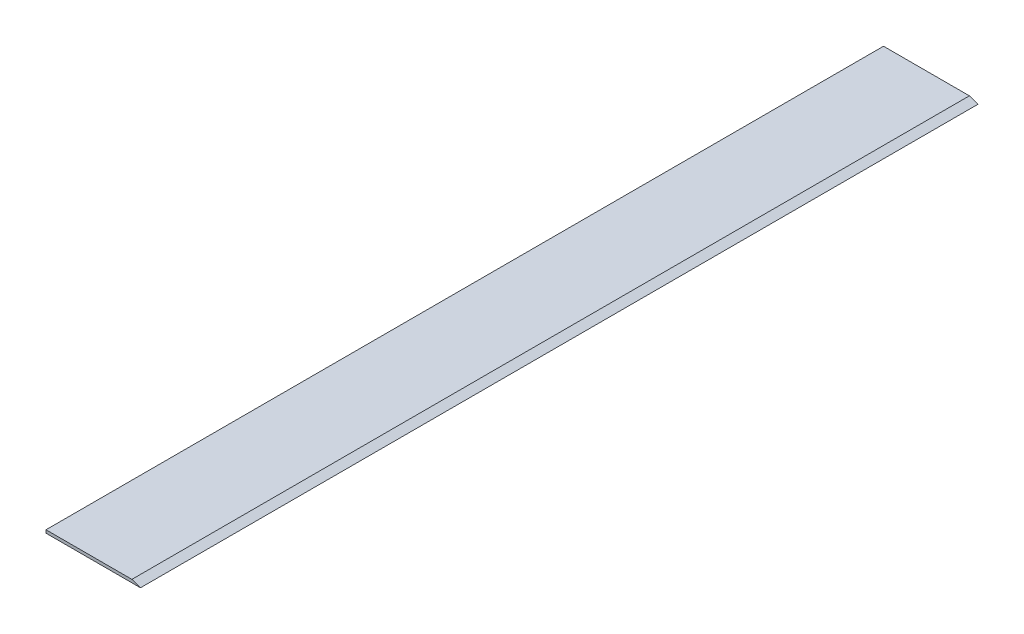
ISO-10303-21;
HEADER;
FILE_DESCRIPTION(('STEP AP214'),'2;1');
FILE_NAME('part.step','',(''),(''),'','','');
FILE_SCHEMA(('AUTOMOTIVE_DESIGN { 1 0 10303 214 1 1 1 1 }'));
ENDSEC;
DATA;
#1=APPLICATION_CONTEXT('core data for automotive mechanical design processes');
#2=APPLICATION_PROTOCOL_DEFINITION('international standard','automotive_design',2000,#1);
#3=PRODUCT_CONTEXT('',#1,'mechanical');
#4=PRODUCT('Part','Part','',(#3));
#5=PRODUCT_RELATED_PRODUCT_CATEGORY('part','',(#4));
#6=PRODUCT_DEFINITION_FORMATION('','',#4);
#7=PRODUCT_DEFINITION_CONTEXT('part definition',#1,'design');
#8=PRODUCT_DEFINITION('design','',#6,#7);
#9=PRODUCT_DEFINITION_SHAPE('','',#8);
#10=(LENGTH_UNIT() NAMED_UNIT(*) SI_UNIT(.MILLI.,.METRE.));
#11=(NAMED_UNIT(*) PLANE_ANGLE_UNIT() SI_UNIT($,.RADIAN.));
#12=(NAMED_UNIT(*) SI_UNIT($,.STERADIAN.) SOLID_ANGLE_UNIT());
#13=UNCERTAINTY_MEASURE_WITH_UNIT(LENGTH_MEASURE(1.E-05),#10,'distance_accuracy_value','');
#14=(GEOMETRIC_REPRESENTATION_CONTEXT(3) GLOBAL_UNCERTAINTY_ASSIGNED_CONTEXT((#13)) GLOBAL_UNIT_ASSIGNED_CONTEXT((#10,
#11,#12)) REPRESENTATION_CONTEXT('',''));
#15=CARTESIAN_POINT('',(0.,0.,0.));
#16=DIRECTION('',(0.,0.,1.));
#17=DIRECTION('',(1.,0.,0.));
#18=AXIS2_PLACEMENT_3D('',#15,#16,#17);
#19=CARTESIAN_POINT('',(0.,0.7,195.));
#20=DIRECTION('',(1.,0.,0.));
#21=DIRECTION('',(0.,0.,-1.));
#22=AXIS2_PLACEMENT_3D('',#19,#20,#21);
#23=PLANE('',#22);
#24=DIRECTION('',(0.,-1.,0.));
#25=VECTOR('',#24,1.);
#26=CARTESIAN_POINT('',(0.,0.7,0.));
#27=LINE('',#26,#25);
#28=CARTESIAN_POINT('',(0.,0.7,0.));
#29=VERTEX_POINT('',#28);
#30=CARTESIAN_POINT('',(0.,0.,0.));
#31=VERTEX_POINT('',#30);
#32=EDGE_CURVE('E97',#29,#31,#27,.T.);
#33=ORIENTED_EDGE('',*,*,#32,.T.);
#34=DIRECTION('',(0.,0.,-1.));
#35=VECTOR('',#34,1.);
#36=CARTESIAN_POINT('',(0.,0.,195.));
#37=LINE('',#36,#35);
#38=CARTESIAN_POINT('',(0.,0.,195.));
#39=VERTEX_POINT('',#38);
#40=EDGE_CURVE('E11',#39,#31,#37,.T.);
#41=ORIENTED_EDGE('',*,*,#40,.F.);
#42=DIRECTION('',(0.,-1.,0.));
#43=VECTOR('',#42,1.);
#44=CARTESIAN_POINT('',(0.,0.7,195.));
#45=LINE('',#44,#43);
#46=CARTESIAN_POINT('',(0.,0.7,195.));
#47=VERTEX_POINT('',#46);
#48=EDGE_CURVE('E85',#47,#39,#45,.T.);
#49=ORIENTED_EDGE('',*,*,#48,.F.);
#50=DIRECTION('',(0.,0.,-1.));
#51=VECTOR('',#50,1.);
#52=CARTESIAN_POINT('',(0.,0.7,195.));
#53=LINE('',#52,#51);
#54=EDGE_CURVE('E93',#47,#29,#53,.T.);
#55=ORIENTED_EDGE('',*,*,#54,.T.);
#56=EDGE_LOOP('',(#33,#41,#49,#55));
#57=FACE_BOUND('',#56,.T.);
#58=ADVANCED_FACE('F34',(#57),#23,.F.);
#59=CARTESIAN_POINT('',(0.,0.,195.));
#60=DIRECTION('',(0.,1.,0.));
#61=DIRECTION('',(0.,0.,1.));
#62=AXIS2_PLACEMENT_3D('',#59,#60,#61);
#63=PLANE('',#62);
#64=DIRECTION('',(1.,0.,0.));
#65=VECTOR('',#64,1.);
#66=CARTESIAN_POINT('',(0.,0.,0.));
#67=LINE('',#66,#65);
#68=CARTESIAN_POINT('',(22.,0.,0.));
#69=VERTEX_POINT('',#68);
#70=EDGE_CURVE('E89',#31,#69,#67,.T.);
#71=ORIENTED_EDGE('',*,*,#70,.T.);
#72=DIRECTION('',(0.,0.,-1.));
#73=VECTOR('',#72,1.);
#74=CARTESIAN_POINT('',(22.,0.,195.));
#75=LINE('',#74,#73);
#76=CARTESIAN_POINT('',(22.,0.,195.));
#77=VERTEX_POINT('',#76);
#78=EDGE_CURVE('E42',#77,#69,#75,.T.);
#79=ORIENTED_EDGE('',*,*,#78,.F.);
#80=DIRECTION('',(1.,0.,0.));
#81=VECTOR('',#80,1.);
#82=CARTESIAN_POINT('',(0.,0.,195.));
#83=LINE('',#82,#81);
#84=EDGE_CURVE('E80',#39,#77,#83,.T.);
#85=ORIENTED_EDGE('',*,*,#84,.F.);
#86=ORIENTED_EDGE('',*,*,#40,.T.);
#87=EDGE_LOOP('',(#71,#79,#85,#86));
#88=FACE_BOUND('',#87,.T.);
#89=ADVANCED_FACE('F88',(#88),#63,.F.);
#90=CARTESIAN_POINT('',(22.,0.,195.));
#91=DIRECTION('',(-0.330350424728106,-0.943858356366017,0.));
#92=DIRECTION('',(0.943858356366017,-0.330350424728106,0.));
#93=AXIS2_PLACEMENT_3D('',#90,#91,#92);
#94=PLANE('',#93);
#95=DIRECTION('',(-0.943858356366017,0.330350424728106,0.));
#96=VECTOR('',#95,1.);
#97=CARTESIAN_POINT('',(22.,0.,0.));
#98=LINE('',#97,#96);
#99=CARTESIAN_POINT('',(20.,0.700000000000002,0.));
#100=VERTEX_POINT('',#99);
#101=EDGE_CURVE('E67',#69,#100,#98,.T.);
#102=ORIENTED_EDGE('',*,*,#101,.T.);
#103=DIRECTION('',(0.,0.,-1.));
#104=VECTOR('',#103,1.);
#105=CARTESIAN_POINT('',(20.,0.700000000000002,195.));
#106=LINE('',#105,#104);
#107=CARTESIAN_POINT('',(20.,0.700000000000002,195.));
#108=VERTEX_POINT('',#107);
#109=EDGE_CURVE('E90',#108,#100,#106,.T.);
#110=ORIENTED_EDGE('',*,*,#109,.F.);
#111=DIRECTION('',(-0.943858356366017,0.330350424728106,0.));
#112=VECTOR('',#111,1.);
#113=CARTESIAN_POINT('',(22.,0.,195.));
#114=LINE('',#113,#112);
#115=EDGE_CURVE('E83',#77,#108,#114,.T.);
#116=ORIENTED_EDGE('',*,*,#115,.F.);
#117=ORIENTED_EDGE('',*,*,#78,.T.);
#118=EDGE_LOOP('',(#102,#110,#116,#117));
#119=FACE_BOUND('',#118,.T.);
#120=ADVANCED_FACE('F91',(#119),#94,.F.);
#121=CARTESIAN_POINT('',(20.,0.700000000000002,195.));
#122=DIRECTION('',(0.,-1.,0.));
#123=DIRECTION('',(1.,0.,0.));
#124=AXIS2_PLACEMENT_3D('',#121,#122,#123);
#125=PLANE('',#124);
#126=DIRECTION('',(-1.,0.,0.));
#127=VECTOR('',#126,1.);
#128=CARTESIAN_POINT('',(20.,0.700000000000002,0.));
#129=LINE('',#128,#127);
#130=EDGE_CURVE('E73',#100,#29,#129,.T.);
#131=ORIENTED_EDGE('',*,*,#130,.T.);
#132=ORIENTED_EDGE('',*,*,#54,.F.);
#133=DIRECTION('',(-1.,0.,0.));
#134=VECTOR('',#133,1.);
#135=CARTESIAN_POINT('',(20.,0.700000000000002,195.));
#136=LINE('',#135,#134);
#137=EDGE_CURVE('E50',#108,#47,#136,.T.);
#138=ORIENTED_EDGE('',*,*,#137,.F.);
#139=ORIENTED_EDGE('',*,*,#109,.T.);
#140=EDGE_LOOP('',(#131,#132,#138,#139));
#141=FACE_BOUND('',#140,.T.);
#142=ADVANCED_FACE('F104',(#141),#125,.F.);
#143=CARTESIAN_POINT('',(0.,0.,195.));
#144=DIRECTION('',(0.,0.,1.));
#145=DIRECTION('',(1.,0.,0.));
#146=AXIS2_PLACEMENT_3D('',#143,#144,#145);
#147=PLANE('',#146);
#148=ORIENTED_EDGE('',*,*,#48,.T.);
#149=ORIENTED_EDGE('',*,*,#84,.T.);
#150=ORIENTED_EDGE('',*,*,#115,.T.);
#151=ORIENTED_EDGE('',*,*,#137,.T.);
#152=EDGE_LOOP('',(#148,#149,#150,#151));
#153=FACE_BOUND('',#152,.T.);
#154=ADVANCED_FACE('F81',(#153),#147,.T.);
#155=CARTESIAN_POINT('',(0.,0.,0.));
#156=DIRECTION('',(0.,0.,1.));
#157=DIRECTION('',(1.,0.,0.));
#158=AXIS2_PLACEMENT_3D('',#155,#156,#157);
#159=PLANE('',#158);
#160=ORIENTED_EDGE('',*,*,#32,.F.);
#161=ORIENTED_EDGE('',*,*,#130,.F.);
#162=ORIENTED_EDGE('',*,*,#101,.F.);
#163=ORIENTED_EDGE('',*,*,#70,.F.);
#164=EDGE_LOOP('',(#160,#161,#162,#163));
#165=FACE_BOUND('',#164,.T.);
#166=ADVANCED_FACE('F107',(#165),#159,.F.);
#167=CLOSED_SHELL('',(#58,#89,#120,#142,#154,#166));
#168=MANIFOLD_SOLID_BREP('B2',#167);
#169=ADVANCED_BREP_SHAPE_REPRESENTATION('',(#18,#168),#14);
#170=SHAPE_DEFINITION_REPRESENTATION(#9,#169);
ENDSEC;
END-ISO-10303-21;
